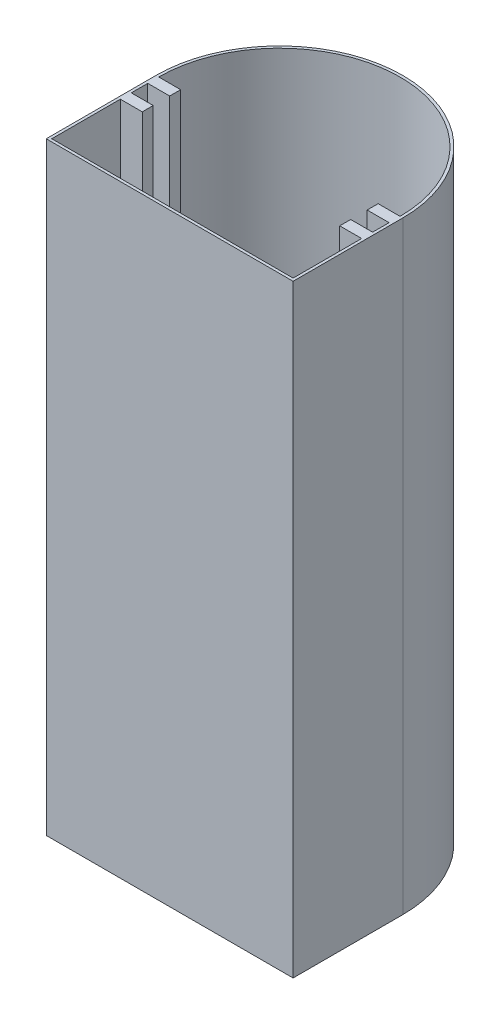
ISO-10303-21;
HEADER;
FILE_DESCRIPTION(('STEP AP214'),'2;1');
FILE_NAME('part.step','',(''),(''),'','','');
FILE_SCHEMA(('AUTOMOTIVE_DESIGN { 1 0 10303 214 1 1 1 1 }'));
ENDSEC;
DATA;
#1=APPLICATION_CONTEXT('core data for automotive mechanical design processes');
#2=APPLICATION_PROTOCOL_DEFINITION('international standard','automotive_design',2000,#1);
#3=PRODUCT_CONTEXT('',#1,'mechanical');
#4=PRODUCT('Part','Part','',(#3));
#5=PRODUCT_RELATED_PRODUCT_CATEGORY('part','',(#4));
#6=PRODUCT_DEFINITION_FORMATION('','',#4);
#7=PRODUCT_DEFINITION_CONTEXT('part definition',#1,'design');
#8=PRODUCT_DEFINITION('design','',#6,#7);
#9=PRODUCT_DEFINITION_SHAPE('','',#8);
#10=(LENGTH_UNIT() NAMED_UNIT(*) SI_UNIT(.MILLI.,.METRE.));
#11=(NAMED_UNIT(*) PLANE_ANGLE_UNIT() SI_UNIT($,.RADIAN.));
#12=(NAMED_UNIT(*) SI_UNIT($,.STERADIAN.) SOLID_ANGLE_UNIT());
#13=UNCERTAINTY_MEASURE_WITH_UNIT(LENGTH_MEASURE(1.E-05),#10,'distance_accuracy_value','');
#14=(GEOMETRIC_REPRESENTATION_CONTEXT(3) GLOBAL_UNCERTAINTY_ASSIGNED_CONTEXT((#13)) GLOBAL_UNIT_ASSIGNED_CONTEXT((#10,
#11,#12)) REPRESENTATION_CONTEXT('',''));
#15=CARTESIAN_POINT('',(0.,0.,0.));
#16=DIRECTION('',(0.,0.,1.));
#17=DIRECTION('',(1.,0.,0.));
#18=AXIS2_PLACEMENT_3D('',#15,#16,#17);
#19=CARTESIAN_POINT('',(-43.8830935251799,110.,1.70773381294964));
#20=DIRECTION('',(0.,0.,-1.));
#21=DIRECTION('',(-1.,0.,0.));
#22=AXIS2_PLACEMENT_3D('',#19,#20,#21);
#23=PLANE('',#22);
#24=DIRECTION('',(1.,0.,0.));
#25=VECTOR('',#24,1.);
#26=CARTESIAN_POINT('',(-43.8830935251799,0.,1.70773381294964));
#27=LINE('',#26,#25);
#28=CARTESIAN_POINT('',(-43.8830935251799,0.,1.70773381294964));
#29=VERTEX_POINT('',#28);
#30=CARTESIAN_POINT('',(1.11690647482014,0.,1.70773381294964));
#31=VERTEX_POINT('',#30);
#32=EDGE_CURVE('E311',#29,#31,#27,.T.);
#33=ORIENTED_EDGE('',*,*,#32,.T.);
#34=DIRECTION('',(0.,-1.,0.));
#35=VECTOR('',#34,1.);
#36=CARTESIAN_POINT('',(1.11690647482014,110.,1.70773381294964));
#37=LINE('',#36,#35);
#38=CARTESIAN_POINT('',(1.11690647482014,110.,1.70773381294964));
#39=VERTEX_POINT('',#38);
#40=EDGE_CURVE('E11',#39,#31,#37,.T.);
#41=ORIENTED_EDGE('',*,*,#40,.F.);
#42=DIRECTION('',(1.,0.,0.));
#43=VECTOR('',#42,1.);
#44=CARTESIAN_POINT('',(-43.8830935251799,110.,1.70773381294964));
#45=LINE('',#44,#43);
#46=CARTESIAN_POINT('',(-43.8830935251799,110.,1.70773381294964));
#47=VERTEX_POINT('',#46);
#48=EDGE_CURVE('E343',#47,#39,#45,.T.);
#49=ORIENTED_EDGE('',*,*,#48,.F.);
#50=DIRECTION('',(0.,-1.,0.));
#51=VECTOR('',#50,1.);
#52=CARTESIAN_POINT('',(-43.8830935251799,110.,1.70773381294964));
#53=LINE('',#52,#51);
#54=EDGE_CURVE('E57',#47,#29,#53,.T.);
#55=ORIENTED_EDGE('',*,*,#54,.T.);
#56=EDGE_LOOP('',(#33,#41,#49,#55));
#57=FACE_BOUND('',#56,.T.);
#58=ADVANCED_FACE('F33',(#57),#23,.F.);
#59=CARTESIAN_POINT('',(1.11690647482014,110.,1.70773381294964));
#60=DIRECTION('',(-1.,0.,0.));
#61=DIRECTION('',(0.,0.,1.));
#62=AXIS2_PLACEMENT_3D('',#59,#60,#61);
#63=PLANE('',#62);
#64=DIRECTION('',(0.,0.,-1.));
#65=VECTOR('',#64,1.);
#66=CARTESIAN_POINT('',(1.11690647482014,0.,1.70773381294964));
#67=LINE('',#66,#65);
#68=CARTESIAN_POINT('',(1.11690647482014,0.,-18.2922661870504));
#69=VERTEX_POINT('',#68);
#70=EDGE_CURVE('E352',#31,#69,#67,.T.);
#71=ORIENTED_EDGE('',*,*,#70,.T.);
#72=DIRECTION('',(0.,-1.,0.));
#73=VECTOR('',#72,1.);
#74=CARTESIAN_POINT('',(1.11690647482014,110.,-18.2922661870504));
#75=LINE('',#74,#73);
#76=CARTESIAN_POINT('',(1.11690647482014,110.,-18.2922661870504));
#77=VERTEX_POINT('',#76);
#78=EDGE_CURVE('E41',#77,#69,#75,.T.);
#79=ORIENTED_EDGE('',*,*,#78,.F.);
#80=DIRECTION('',(0.,0.,-1.));
#81=VECTOR('',#80,1.);
#82=CARTESIAN_POINT('',(1.11690647482014,110.,1.70773381294964));
#83=LINE('',#82,#81);
#84=EDGE_CURVE('E83',#39,#77,#83,.T.);
#85=ORIENTED_EDGE('',*,*,#84,.F.);
#86=ORIENTED_EDGE('',*,*,#40,.T.);
#87=EDGE_LOOP('',(#71,#79,#85,#86));
#88=FACE_BOUND('',#87,.T.);
#89=ADVANCED_FACE('F375',(#88),#63,.F.);
#90=CARTESIAN_POINT('',(-21.3830935251799,110.,-18.2922661870504));
#91=DIRECTION('',(0.,-1.,0.));
#92=DIRECTION('',(0.,0.,-1.));
#93=AXIS2_PLACEMENT_3D('',#90,#91,#92);
#94=CYLINDRICAL_SURFACE('',#93,22.5);
#95=CARTESIAN_POINT('',(-21.3830935251799,0.,-18.2922661870504));
#96=DIRECTION('',(0.,1.,0.));
#97=DIRECTION('',(0.,0.,1.));
#98=AXIS2_PLACEMENT_3D('',#95,#96,#97);
#99=CIRCLE('',#98,22.5);
#100=CARTESIAN_POINT('',(-43.8830935251799,0.,-18.2922661870504));
#101=VERTEX_POINT('',#100);
#102=EDGE_CURVE('E354',#69,#101,#99,.T.);
#103=ORIENTED_EDGE('',*,*,#102,.T.);
#104=DIRECTION('',(0.,-1.,0.));
#105=VECTOR('',#104,1.);
#106=CARTESIAN_POINT('',(-43.8830935251799,110.,-18.2922661870504));
#107=LINE('',#106,#105);
#108=CARTESIAN_POINT('',(-43.8830935251799,110.,-18.2922661870504));
#109=VERTEX_POINT('',#108);
#110=EDGE_CURVE('E360',#109,#101,#107,.T.);
#111=ORIENTED_EDGE('',*,*,#110,.F.);
#112=CARTESIAN_POINT('',(-21.3830935251799,110.,-18.2922661870504));
#113=DIRECTION('',(0.,1.,0.));
#114=DIRECTION('',(0.,0.,1.));
#115=AXIS2_PLACEMENT_3D('',#112,#113,#114);
#116=CIRCLE('',#115,22.5);
#117=EDGE_CURVE('E347',#77,#109,#116,.T.);
#118=ORIENTED_EDGE('',*,*,#117,.F.);
#119=ORIENTED_EDGE('',*,*,#78,.T.);
#120=EDGE_LOOP('',(#103,#111,#118,#119));
#121=FACE_BOUND('',#120,.T.);
#122=ADVANCED_FACE('F366',(#121),#94,.T.);
#123=CARTESIAN_POINT('',(-43.8830935251799,110.,1.70773381294964));
#124=DIRECTION('',(-1.,0.,0.));
#125=DIRECTION('',(0.,0.,1.));
#126=AXIS2_PLACEMENT_3D('',#123,#124,#125);
#127=PLANE('',#126);
#128=CARTESIAN_POINT('',(-43.8830935251799,55.,-4.95893285371703));
#129=DIRECTION('',(-1.,0.,0.));
#130=DIRECTION('',(0.,0.,1.));
#131=AXIS2_PLACEMENT_3D('',#128,#129,#130);
#132=CIRCLE('',#131,2.875);
#133=CARTESIAN_POINT('',(-43.8830935251799,55.,-2.08393285371702));
#134=VERTEX_POINT('',#133);
#135=EDGE_CURVE('E217',#134,#134,#132,.T.);
#136=ORIENTED_EDGE('',*,*,#135,.F.);
#137=EDGE_LOOP('',(#136));
#138=FACE_BOUND('',#137,.T.);
#139=DIRECTION('',(0.,0.,-1.));
#140=VECTOR('',#139,1.);
#141=CARTESIAN_POINT('',(-43.8830935251799,0.,1.70773381294964));
#142=LINE('',#141,#140);
#143=EDGE_CURVE('E345',#29,#101,#142,.T.);
#144=ORIENTED_EDGE('',*,*,#143,.F.);
#145=ORIENTED_EDGE('',*,*,#54,.F.);
#146=DIRECTION('',(0.,0.,-1.));
#147=VECTOR('',#146,1.);
#148=CARTESIAN_POINT('',(-43.8830935251799,110.,1.70773381294964));
#149=LINE('',#148,#147);
#150=EDGE_CURVE('E349',#47,#109,#149,.T.);
#151=ORIENTED_EDGE('',*,*,#150,.T.);
#152=ORIENTED_EDGE('',*,*,#110,.T.);
#153=EDGE_LOOP('',(#144,#145,#151,#152));
#154=FACE_BOUND('',#153,.T.);
#155=ADVANCED_FACE('F370',(#138,#154),#127,.T.);
#156=CARTESIAN_POINT('',(-21.3830935251799,110.,-18.2922661870504));
#157=DIRECTION('',(0.,1.,0.));
#158=DIRECTION('',(0.,0.,1.));
#159=AXIS2_PLACEMENT_3D('',#156,#157,#158);
#160=PLANE('',#159);
#161=CARTESIAN_POINT('',(-21.3830935251799,110.,-18.2922661870504));
#162=DIRECTION('',(0.,1.,0.));
#163=DIRECTION('',(0.,0.,1.));
#164=AXIS2_PLACEMENT_3D('',#161,#162,#163);
#165=CIRCLE('',#164,22.);
#166=CARTESIAN_POINT('',(0.616906474820142,110.,-18.2922661870504));
#167=VERTEX_POINT('',#166);
#168=CARTESIAN_POINT('',(-43.3830935251799,110.,-18.2922661870504));
#169=VERTEX_POINT('',#168);
#170=EDGE_CURVE('E48',#167,#169,#165,.T.);
#171=ORIENTED_EDGE('',*,*,#170,.F.);
#172=DIRECTION('',(1.,0.,0.));
#173=VECTOR('',#172,1.);
#174=CARTESIAN_POINT('',(0.616906474820142,110.,-18.2922661870504));
#175=LINE('',#174,#173);
#176=CARTESIAN_POINT('',(-3.38309352517986,110.,-18.2922661870504));
#177=VERTEX_POINT('',#176);
#178=EDGE_CURVE('E211',#177,#167,#175,.T.);
#179=ORIENTED_EDGE('',*,*,#178,.F.);
#180=DIRECTION('',(0.,0.,-1.));
#181=VECTOR('',#180,1.);
#182=CARTESIAN_POINT('',(-3.38309352517986,110.,-18.2922661870504));
#183=LINE('',#182,#181);
#184=CARTESIAN_POINT('',(-3.38309352517986,110.,-16.2922661870504));
#185=VERTEX_POINT('',#184);
#186=EDGE_CURVE('E214',#185,#177,#183,.T.);
#187=ORIENTED_EDGE('',*,*,#186,.F.);
#188=DIRECTION('',(-1.,0.,0.));
#189=VECTOR('',#188,1.);
#190=CARTESIAN_POINT('',(-3.38309352517986,110.,-16.2922661870504));
#191=LINE('',#190,#189);
#192=CARTESIAN_POINT('',(0.616906474820142,110.,-16.2922661870504));
#193=VERTEX_POINT('',#192);
#194=EDGE_CURVE('E304',#193,#185,#191,.T.);
#195=ORIENTED_EDGE('',*,*,#194,.F.);
#196=DIRECTION('',(0.,0.,-1.));
#197=VECTOR('',#196,1.);
#198=CARTESIAN_POINT('',(0.616906474820142,110.,-16.2922661870504));
#199=LINE('',#198,#197);
#200=CARTESIAN_POINT('',(0.616906474820142,110.,-13.2922661870504));
#201=VERTEX_POINT('',#200);
#202=EDGE_CURVE('E301',#201,#193,#199,.T.);
#203=ORIENTED_EDGE('',*,*,#202,.F.);
#204=DIRECTION('',(1.,0.,0.));
#205=VECTOR('',#204,1.);
#206=CARTESIAN_POINT('',(0.616906474820142,110.,-13.2922661870504));
#207=LINE('',#206,#205);
#208=CARTESIAN_POINT('',(-3.38309352517986,110.,-13.2922661870504));
#209=VERTEX_POINT('',#208);
#210=EDGE_CURVE('E298',#209,#201,#207,.T.);
#211=ORIENTED_EDGE('',*,*,#210,.F.);
#212=DIRECTION('',(0.,0.,-1.));
#213=VECTOR('',#212,1.);
#214=CARTESIAN_POINT('',(-3.38309352517986,110.,-13.2922661870504));
#215=LINE('',#214,#213);
#216=CARTESIAN_POINT('',(-3.38309352517986,110.,-11.2922661870504));
#217=VERTEX_POINT('',#216);
#218=EDGE_CURVE('E295',#217,#209,#215,.T.);
#219=ORIENTED_EDGE('',*,*,#218,.F.);
#220=DIRECTION('',(-1.,0.,0.));
#221=VECTOR('',#220,1.);
#222=CARTESIAN_POINT('',(-3.38309352517986,110.,-11.2922661870504));
#223=LINE('',#222,#221);
#224=CARTESIAN_POINT('',(0.616906474820142,110.,-11.2922661870504));
#225=VERTEX_POINT('',#224);
#226=EDGE_CURVE('E292',#225,#217,#223,.T.);
#227=ORIENTED_EDGE('',*,*,#226,.F.);
#228=DIRECTION('',(0.,0.,-1.));
#229=VECTOR('',#228,1.);
#230=CARTESIAN_POINT('',(0.616906474820142,110.,-11.2922661870504));
#231=LINE('',#230,#229);
#232=CARTESIAN_POINT('',(0.616906474820142,110.,1.20773381294964));
#233=VERTEX_POINT('',#232);
#234=EDGE_CURVE('E289',#233,#225,#231,.T.);
#235=ORIENTED_EDGE('',*,*,#234,.F.);
#236=DIRECTION('',(1.,0.,0.));
#237=VECTOR('',#236,1.);
#238=CARTESIAN_POINT('',(-43.3830935251799,110.,1.20773381294964));
#239=LINE('',#238,#237);
#240=CARTESIAN_POINT('',(-43.3830935251799,110.,1.20773381294964));
#241=VERTEX_POINT('',#240);
#242=EDGE_CURVE('E286',#241,#233,#239,.T.);
#243=ORIENTED_EDGE('',*,*,#242,.F.);
#244=DIRECTION('',(0.,0.,1.));
#245=VECTOR('',#244,1.);
#246=CARTESIAN_POINT('',(-43.3830935251799,110.,-11.2922661870504));
#247=LINE('',#246,#245);
#248=CARTESIAN_POINT('',(-43.3830935251799,110.,-11.2922661870504));
#249=VERTEX_POINT('',#248);
#250=EDGE_CURVE('E283',#249,#241,#247,.T.);
#251=ORIENTED_EDGE('',*,*,#250,.F.);
#252=DIRECTION('',(-1.,0.,0.));
#253=VECTOR('',#252,1.);
#254=CARTESIAN_POINT('',(-39.3830935251799,110.,-11.2922661870504));
#255=LINE('',#254,#253);
#256=CARTESIAN_POINT('',(-39.3830935251799,110.,-11.2922661870504));
#257=VERTEX_POINT('',#256);
#258=EDGE_CURVE('E280',#257,#249,#255,.T.);
#259=ORIENTED_EDGE('',*,*,#258,.F.);
#260=DIRECTION('',(0.,0.,1.));
#261=VECTOR('',#260,1.);
#262=CARTESIAN_POINT('',(-39.3830935251799,110.,-13.2922661870504));
#263=LINE('',#262,#261);
#264=CARTESIAN_POINT('',(-39.3830935251799,110.,-13.2922661870504));
#265=VERTEX_POINT('',#264);
#266=EDGE_CURVE('E277',#265,#257,#263,.T.);
#267=ORIENTED_EDGE('',*,*,#266,.F.);
#268=DIRECTION('',(1.,0.,0.));
#269=VECTOR('',#268,1.);
#270=CARTESIAN_POINT('',(-43.3830935251799,110.,-13.2922661870504));
#271=LINE('',#270,#269);
#272=CARTESIAN_POINT('',(-43.3830935251799,110.,-13.2922661870504));
#273=VERTEX_POINT('',#272);
#274=EDGE_CURVE('E274',#273,#265,#271,.T.);
#275=ORIENTED_EDGE('',*,*,#274,.F.);
#276=DIRECTION('',(0.,0.,1.));
#277=VECTOR('',#276,1.);
#278=CARTESIAN_POINT('',(-43.3830935251799,110.,-16.2922661870504));
#279=LINE('',#278,#277);
#280=CARTESIAN_POINT('',(-43.3830935251799,110.,-16.2922661870504));
#281=VERTEX_POINT('',#280);
#282=EDGE_CURVE('E271',#281,#273,#279,.T.);
#283=ORIENTED_EDGE('',*,*,#282,.F.);
#284=DIRECTION('',(-1.,0.,0.));
#285=VECTOR('',#284,1.);
#286=CARTESIAN_POINT('',(-39.3830935251799,110.,-16.2922661870504));
#287=LINE('',#286,#285);
#288=CARTESIAN_POINT('',(-39.3830935251799,110.,-16.2922661870504));
#289=VERTEX_POINT('',#288);
#290=EDGE_CURVE('E268',#289,#281,#287,.T.);
#291=ORIENTED_EDGE('',*,*,#290,.F.);
#292=DIRECTION('',(0.,0.,1.));
#293=VECTOR('',#292,1.);
#294=CARTESIAN_POINT('',(-39.3830935251799,110.,-18.2922661870504));
#295=LINE('',#294,#293);
#296=CARTESIAN_POINT('',(-39.3830935251799,110.,-18.2922661870504));
#297=VERTEX_POINT('',#296);
#298=EDGE_CURVE('E265',#297,#289,#295,.T.);
#299=ORIENTED_EDGE('',*,*,#298,.F.);
#300=DIRECTION('',(1.,0.,0.));
#301=VECTOR('',#300,1.);
#302=CARTESIAN_POINT('',(-43.3830935251799,110.,-18.2922661870504));
#303=LINE('',#302,#301);
#304=EDGE_CURVE('E263',#169,#297,#303,.T.);
#305=ORIENTED_EDGE('',*,*,#304,.F.);
#306=EDGE_LOOP('',(#171,#179,#187,#195,#203,#211,#219,#227,#235,#243,#251,#259,#267,#275,#283,
#291,#299,#305));
#307=FACE_BOUND('',#306,.T.);
#308=ORIENTED_EDGE('',*,*,#48,.T.);
#309=ORIENTED_EDGE('',*,*,#84,.T.);
#310=ORIENTED_EDGE('',*,*,#117,.T.);
#311=ORIENTED_EDGE('',*,*,#150,.F.);
#312=EDGE_LOOP('',(#308,#309,#310,#311));
#313=FACE_BOUND('',#312,.T.);
#314=ADVANCED_FACE('F373',(#307,#313),#160,.T.);
#315=CARTESIAN_POINT('',(-21.3830935251799,0.,-18.2922661870504));
#316=DIRECTION('',(0.,1.,0.));
#317=DIRECTION('',(0.,0.,1.));
#318=AXIS2_PLACEMENT_3D('',#315,#316,#317);
#319=PLANE('',#318);
#320=ORIENTED_EDGE('',*,*,#32,.F.);
#321=ORIENTED_EDGE('',*,*,#143,.T.);
#322=ORIENTED_EDGE('',*,*,#102,.F.);
#323=ORIENTED_EDGE('',*,*,#70,.F.);
#324=EDGE_LOOP('',(#320,#321,#322,#323));
#325=FACE_BOUND('',#324,.T.);
#326=ADVANCED_FACE('F369',(#325),#319,.F.);
#327=CARTESIAN_POINT('',(-21.3830935251799,0.5,-18.2922661870504));
#328=DIRECTION('',(0.,1.,0.));
#329=DIRECTION('',(0.,0.,1.));
#330=AXIS2_PLACEMENT_3D('',#327,#328,#329);
#331=CYLINDRICAL_SURFACE('',#330,22.);
#332=ORIENTED_EDGE('',*,*,#170,.T.);
#333=DIRECTION('',(0.,1.,0.));
#334=VECTOR('',#333,1.);
#335=CARTESIAN_POINT('',(-43.3830935251799,0.5,-18.2922661870504));
#336=LINE('',#335,#334);
#337=CARTESIAN_POINT('',(-43.3830935251799,0.5,-18.2922661870504));
#338=VERTEX_POINT('',#337);
#339=EDGE_CURVE('E188',#338,#169,#336,.T.);
#340=ORIENTED_EDGE('',*,*,#339,.F.);
#341=CARTESIAN_POINT('',(-21.3830935251799,0.5,-18.2922661870504));
#342=DIRECTION('',(0.,1.,0.));
#343=DIRECTION('',(0.,0.,1.));
#344=AXIS2_PLACEMENT_3D('',#341,#342,#343);
#345=CIRCLE('',#344,22.);
#346=CARTESIAN_POINT('',(0.616906474820142,0.5,-18.2922661870504));
#347=VERTEX_POINT('',#346);
#348=EDGE_CURVE('E192',#347,#338,#345,.T.);
#349=ORIENTED_EDGE('',*,*,#348,.F.);
#350=DIRECTION('',(0.,1.,0.));
#351=VECTOR('',#350,1.);
#352=CARTESIAN_POINT('',(0.616906474820142,0.5,-18.2922661870504));
#353=LINE('',#352,#351);
#354=EDGE_CURVE('E309',#347,#167,#353,.T.);
#355=ORIENTED_EDGE('',*,*,#354,.T.);
#356=EDGE_LOOP('',(#332,#340,#349,#355));
#357=FACE_BOUND('',#356,.T.);
#358=ADVANCED_FACE('F190',(#357),#331,.F.);
#359=CARTESIAN_POINT('',(0.616906474820142,0.5,-18.2922661870504));
#360=DIRECTION('',(0.,0.,1.));
#361=DIRECTION('',(1.,0.,0.));
#362=AXIS2_PLACEMENT_3D('',#359,#360,#361);
#363=PLANE('',#362);
#364=ORIENTED_EDGE('',*,*,#178,.T.);
#365=ORIENTED_EDGE('',*,*,#354,.F.);
#366=DIRECTION('',(1.,0.,0.));
#367=VECTOR('',#366,1.);
#368=CARTESIAN_POINT('',(0.616906474820142,0.5,-18.2922661870504));
#369=LINE('',#368,#367);
#370=CARTESIAN_POINT('',(-3.38309352517986,0.5,-18.2922661870504));
#371=VERTEX_POINT('',#370);
#372=EDGE_CURVE('E198',#371,#347,#369,.T.);
#373=ORIENTED_EDGE('',*,*,#372,.F.);
#374=DIRECTION('',(0.,1.,0.));
#375=VECTOR('',#374,1.);
#376=CARTESIAN_POINT('',(-3.38309352517986,0.5,-18.2922661870504));
#377=LINE('',#376,#375);
#378=EDGE_CURVE('E312',#371,#177,#377,.T.);
#379=ORIENTED_EDGE('',*,*,#378,.T.);
#380=EDGE_LOOP('',(#364,#365,#373,#379));
#381=FACE_BOUND('',#380,.T.);
#382=ADVANCED_FACE('F393',(#381),#363,.F.);
#383=CARTESIAN_POINT('',(-3.38309352517986,0.5,-18.2922661870504));
#384=DIRECTION('',(1.,0.,0.));
#385=DIRECTION('',(0.,0.,-1.));
#386=AXIS2_PLACEMENT_3D('',#383,#384,#385);
#387=PLANE('',#386);
#388=ORIENTED_EDGE('',*,*,#186,.T.);
#389=ORIENTED_EDGE('',*,*,#378,.F.);
#390=DIRECTION('',(0.,0.,-1.));
#391=VECTOR('',#390,1.);
#392=CARTESIAN_POINT('',(-3.38309352517986,0.5,-18.2922661870504));
#393=LINE('',#392,#391);
#394=CARTESIAN_POINT('',(-3.38309352517986,0.5,-16.2922661870504));
#395=VERTEX_POINT('',#394);
#396=EDGE_CURVE('E259',#395,#371,#393,.T.);
#397=ORIENTED_EDGE('',*,*,#396,.F.);
#398=DIRECTION('',(0.,1.,0.));
#399=VECTOR('',#398,1.);
#400=CARTESIAN_POINT('',(-3.38309352517986,0.5,-16.2922661870504));
#401=LINE('',#400,#399);
#402=EDGE_CURVE('E314',#395,#185,#401,.T.);
#403=ORIENTED_EDGE('',*,*,#402,.T.);
#404=EDGE_LOOP('',(#388,#389,#397,#403));
#405=FACE_BOUND('',#404,.T.);
#406=ADVANCED_FACE('F451',(#405),#387,.F.);
#407=CARTESIAN_POINT('',(-3.38309352517986,0.5,-16.2922661870504));
#408=DIRECTION('',(0.,0.,-1.));
#409=DIRECTION('',(-1.,0.,0.));
#410=AXIS2_PLACEMENT_3D('',#407,#408,#409);
#411=PLANE('',#410);
#412=ORIENTED_EDGE('',*,*,#194,.T.);
#413=ORIENTED_EDGE('',*,*,#402,.F.);
#414=DIRECTION('',(-1.,0.,0.));
#415=VECTOR('',#414,1.);
#416=CARTESIAN_POINT('',(-3.38309352517986,0.5,-16.2922661870504));
#417=LINE('',#416,#415);
#418=CARTESIAN_POINT('',(0.616906474820142,0.5,-16.2922661870504));
#419=VERTEX_POINT('',#418);
#420=EDGE_CURVE('E256',#419,#395,#417,.T.);
#421=ORIENTED_EDGE('',*,*,#420,.F.);
#422=DIRECTION('',(0.,1.,0.));
#423=VECTOR('',#422,1.);
#424=CARTESIAN_POINT('',(0.616906474820142,0.5,-16.2922661870504));
#425=LINE('',#424,#423);
#426=EDGE_CURVE('E316',#419,#193,#425,.T.);
#427=ORIENTED_EDGE('',*,*,#426,.T.);
#428=EDGE_LOOP('',(#412,#413,#421,#427));
#429=FACE_BOUND('',#428,.T.);
#430=ADVANCED_FACE('F447',(#429),#411,.F.);
#431=CARTESIAN_POINT('',(0.616906474820142,0.5,-16.2922661870504));
#432=DIRECTION('',(1.,0.,0.));
#433=DIRECTION('',(0.,0.,-1.));
#434=AXIS2_PLACEMENT_3D('',#431,#432,#433);
#435=PLANE('',#434);
#436=ORIENTED_EDGE('',*,*,#202,.T.);
#437=ORIENTED_EDGE('',*,*,#426,.F.);
#438=DIRECTION('',(0.,0.,-1.));
#439=VECTOR('',#438,1.);
#440=CARTESIAN_POINT('',(0.616906474820142,0.5,-16.2922661870504));
#441=LINE('',#440,#439);
#442=CARTESIAN_POINT('',(0.616906474820142,0.5,-13.2922661870504));
#443=VERTEX_POINT('',#442);
#444=EDGE_CURVE('E253',#443,#419,#441,.T.);
#445=ORIENTED_EDGE('',*,*,#444,.F.);
#446=DIRECTION('',(0.,1.,0.));
#447=VECTOR('',#446,1.);
#448=CARTESIAN_POINT('',(0.616906474820142,0.5,-13.2922661870504));
#449=LINE('',#448,#447);
#450=EDGE_CURVE('E318',#443,#201,#449,.T.);
#451=ORIENTED_EDGE('',*,*,#450,.T.);
#452=EDGE_LOOP('',(#436,#437,#445,#451));
#453=FACE_BOUND('',#452,.T.);
#454=ADVANCED_FACE('F443',(#453),#435,.F.);
#455=CARTESIAN_POINT('',(0.616906474820142,0.5,-13.2922661870504));
#456=DIRECTION('',(0.,0.,1.));
#457=DIRECTION('',(1.,0.,0.));
#458=AXIS2_PLACEMENT_3D('',#455,#456,#457);
#459=PLANE('',#458);
#460=ORIENTED_EDGE('',*,*,#210,.T.);
#461=ORIENTED_EDGE('',*,*,#450,.F.);
#462=DIRECTION('',(1.,0.,0.));
#463=VECTOR('',#462,1.);
#464=CARTESIAN_POINT('',(0.616906474820142,0.5,-13.2922661870504));
#465=LINE('',#464,#463);
#466=CARTESIAN_POINT('',(-3.38309352517986,0.5,-13.2922661870504));
#467=VERTEX_POINT('',#466);
#468=EDGE_CURVE('E250',#467,#443,#465,.T.);
#469=ORIENTED_EDGE('',*,*,#468,.F.);
#470=DIRECTION('',(0.,1.,0.));
#471=VECTOR('',#470,1.);
#472=CARTESIAN_POINT('',(-3.38309352517986,0.5,-13.2922661870504));
#473=LINE('',#472,#471);
#474=EDGE_CURVE('E320',#467,#209,#473,.T.);
#475=ORIENTED_EDGE('',*,*,#474,.T.);
#476=EDGE_LOOP('',(#460,#461,#469,#475));
#477=FACE_BOUND('',#476,.T.);
#478=ADVANCED_FACE('F439',(#477),#459,.F.);
#479=CARTESIAN_POINT('',(-3.38309352517986,0.5,-13.2922661870504));
#480=DIRECTION('',(1.,0.,0.));
#481=DIRECTION('',(0.,0.,-1.));
#482=AXIS2_PLACEMENT_3D('',#479,#480,#481);
#483=PLANE('',#482);
#484=ORIENTED_EDGE('',*,*,#218,.T.);
#485=ORIENTED_EDGE('',*,*,#474,.F.);
#486=DIRECTION('',(0.,0.,-1.));
#487=VECTOR('',#486,1.);
#488=CARTESIAN_POINT('',(-3.38309352517986,0.5,-13.2922661870504));
#489=LINE('',#488,#487);
#490=CARTESIAN_POINT('',(-3.38309352517986,0.5,-11.2922661870504));
#491=VERTEX_POINT('',#490);
#492=EDGE_CURVE('E247',#491,#467,#489,.T.);
#493=ORIENTED_EDGE('',*,*,#492,.F.);
#494=DIRECTION('',(0.,1.,0.));
#495=VECTOR('',#494,1.);
#496=CARTESIAN_POINT('',(-3.38309352517986,0.5,-11.2922661870504));
#497=LINE('',#496,#495);
#498=EDGE_CURVE('E322',#491,#217,#497,.T.);
#499=ORIENTED_EDGE('',*,*,#498,.T.);
#500=EDGE_LOOP('',(#484,#485,#493,#499));
#501=FACE_BOUND('',#500,.T.);
#502=ADVANCED_FACE('F435',(#501),#483,.F.);
#503=CARTESIAN_POINT('',(-3.38309352517986,0.5,-11.2922661870504));
#504=DIRECTION('',(0.,0.,-1.));
#505=DIRECTION('',(-1.,0.,0.));
#506=AXIS2_PLACEMENT_3D('',#503,#504,#505);
#507=PLANE('',#506);
#508=ORIENTED_EDGE('',*,*,#226,.T.);
#509=ORIENTED_EDGE('',*,*,#498,.F.);
#510=DIRECTION('',(-1.,0.,0.));
#511=VECTOR('',#510,1.);
#512=CARTESIAN_POINT('',(-3.38309352517986,0.5,-11.2922661870504));
#513=LINE('',#512,#511);
#514=CARTESIAN_POINT('',(0.616906474820142,0.5,-11.2922661870504));
#515=VERTEX_POINT('',#514);
#516=EDGE_CURVE('E244',#515,#491,#513,.T.);
#517=ORIENTED_EDGE('',*,*,#516,.F.);
#518=DIRECTION('',(0.,1.,0.));
#519=VECTOR('',#518,1.);
#520=CARTESIAN_POINT('',(0.616906474820142,0.5,-11.2922661870504));
#521=LINE('',#520,#519);
#522=EDGE_CURVE('E324',#515,#225,#521,.T.);
#523=ORIENTED_EDGE('',*,*,#522,.T.);
#524=EDGE_LOOP('',(#508,#509,#517,#523));
#525=FACE_BOUND('',#524,.T.);
#526=ADVANCED_FACE('F431',(#525),#507,.F.);
#527=CARTESIAN_POINT('',(0.616906474820142,0.5,-11.2922661870504));
#528=DIRECTION('',(1.,0.,0.));
#529=DIRECTION('',(0.,0.,-1.));
#530=AXIS2_PLACEMENT_3D('',#527,#528,#529);
#531=PLANE('',#530);
#532=ORIENTED_EDGE('',*,*,#234,.T.);
#533=ORIENTED_EDGE('',*,*,#522,.F.);
#534=DIRECTION('',(0.,0.,-1.));
#535=VECTOR('',#534,1.);
#536=CARTESIAN_POINT('',(0.616906474820142,0.5,-11.2922661870504));
#537=LINE('',#536,#535);
#538=CARTESIAN_POINT('',(0.616906474820142,0.5,1.20773381294964));
#539=VERTEX_POINT('',#538);
#540=EDGE_CURVE('E241',#539,#515,#537,.T.);
#541=ORIENTED_EDGE('',*,*,#540,.F.);
#542=DIRECTION('',(0.,1.,0.));
#543=VECTOR('',#542,1.);
#544=CARTESIAN_POINT('',(0.616906474820142,0.5,1.20773381294964));
#545=LINE('',#544,#543);
#546=EDGE_CURVE('E326',#539,#233,#545,.T.);
#547=ORIENTED_EDGE('',*,*,#546,.T.);
#548=EDGE_LOOP('',(#532,#533,#541,#547));
#549=FACE_BOUND('',#548,.T.);
#550=ADVANCED_FACE('F427',(#549),#531,.F.);
#551=CARTESIAN_POINT('',(-43.3830935251799,0.5,1.20773381294964));
#552=DIRECTION('',(0.,0.,1.));
#553=DIRECTION('',(1.,0.,0.));
#554=AXIS2_PLACEMENT_3D('',#551,#552,#553);
#555=PLANE('',#554);
#556=ORIENTED_EDGE('',*,*,#242,.T.);
#557=ORIENTED_EDGE('',*,*,#546,.F.);
#558=DIRECTION('',(1.,0.,0.));
#559=VECTOR('',#558,1.);
#560=CARTESIAN_POINT('',(-43.3830935251799,0.5,1.20773381294964));
#561=LINE('',#560,#559);
#562=CARTESIAN_POINT('',(-43.3830935251799,0.5,1.20773381294964));
#563=VERTEX_POINT('',#562);
#564=EDGE_CURVE('E238',#563,#539,#561,.T.);
#565=ORIENTED_EDGE('',*,*,#564,.F.);
#566=DIRECTION('',(0.,1.,0.));
#567=VECTOR('',#566,1.);
#568=CARTESIAN_POINT('',(-43.3830935251799,0.5,1.20773381294964));
#569=LINE('',#568,#567);
#570=EDGE_CURVE('E328',#563,#241,#569,.T.);
#571=ORIENTED_EDGE('',*,*,#570,.T.);
#572=EDGE_LOOP('',(#556,#557,#565,#571));
#573=FACE_BOUND('',#572,.T.);
#574=ADVANCED_FACE('F423',(#573),#555,.F.);
#575=CARTESIAN_POINT('',(-43.3830935251799,0.5,-11.2922661870504));
#576=DIRECTION('',(-1.,0.,0.));
#577=DIRECTION('',(0.,0.,1.));
#578=AXIS2_PLACEMENT_3D('',#575,#576,#577);
#579=PLANE('',#578);
#580=CARTESIAN_POINT('',(-43.3830935251799,55.,-4.95893285371703));
#581=DIRECTION('',(-1.,0.,0.));
#582=DIRECTION('',(0.,0.,1.));
#583=AXIS2_PLACEMENT_3D('',#580,#581,#582);
#584=CIRCLE('',#583,2.875);
#585=CARTESIAN_POINT('',(-43.3830935251799,55.,-2.08393285371702));
#586=VERTEX_POINT('',#585);
#587=EDGE_CURVE('E36',#586,#586,#584,.T.);
#588=ORIENTED_EDGE('',*,*,#587,.T.);
#589=EDGE_LOOP('',(#588));
#590=FACE_BOUND('',#589,.T.);
#591=ORIENTED_EDGE('',*,*,#250,.T.);
#592=ORIENTED_EDGE('',*,*,#570,.F.);
#593=DIRECTION('',(0.,0.,1.));
#594=VECTOR('',#593,1.);
#595=CARTESIAN_POINT('',(-43.3830935251799,0.5,-11.2922661870504));
#596=LINE('',#595,#594);
#597=CARTESIAN_POINT('',(-43.3830935251799,0.5,-11.2922661870504));
#598=VERTEX_POINT('',#597);
#599=EDGE_CURVE('E235',#598,#563,#596,.T.);
#600=ORIENTED_EDGE('',*,*,#599,.F.);
#601=DIRECTION('',(0.,1.,0.));
#602=VECTOR('',#601,1.);
#603=CARTESIAN_POINT('',(-43.3830935251799,0.5,-11.2922661870504));
#604=LINE('',#603,#602);
#605=EDGE_CURVE('E330',#598,#249,#604,.T.);
#606=ORIENTED_EDGE('',*,*,#605,.T.);
#607=EDGE_LOOP('',(#591,#592,#600,#606));
#608=FACE_BOUND('',#607,.T.);
#609=ADVANCED_FACE('F419',(#590,#608),#579,.F.);
#610=CARTESIAN_POINT('',(-39.3830935251799,0.5,-11.2922661870504));
#611=DIRECTION('',(0.,0.,-1.));
#612=DIRECTION('',(-1.,0.,0.));
#613=AXIS2_PLACEMENT_3D('',#610,#611,#612);
#614=PLANE('',#613);
#615=ORIENTED_EDGE('',*,*,#258,.T.);
#616=ORIENTED_EDGE('',*,*,#605,.F.);
#617=DIRECTION('',(-1.,0.,0.));
#618=VECTOR('',#617,1.);
#619=CARTESIAN_POINT('',(-39.3830935251799,0.5,-11.2922661870504));
#620=LINE('',#619,#618);
#621=CARTESIAN_POINT('',(-39.3830935251799,0.5,-11.2922661870504));
#622=VERTEX_POINT('',#621);
#623=EDGE_CURVE('E232',#622,#598,#620,.T.);
#624=ORIENTED_EDGE('',*,*,#623,.F.);
#625=DIRECTION('',(0.,1.,0.));
#626=VECTOR('',#625,1.);
#627=CARTESIAN_POINT('',(-39.3830935251799,0.5,-11.2922661870504));
#628=LINE('',#627,#626);
#629=EDGE_CURVE('E332',#622,#257,#628,.T.);
#630=ORIENTED_EDGE('',*,*,#629,.T.);
#631=EDGE_LOOP('',(#615,#616,#624,#630));
#632=FACE_BOUND('',#631,.T.);
#633=ADVANCED_FACE('F415',(#632),#614,.F.);
#634=CARTESIAN_POINT('',(-39.3830935251799,0.5,-13.2922661870504));
#635=DIRECTION('',(-1.,0.,0.));
#636=DIRECTION('',(0.,0.,1.));
#637=AXIS2_PLACEMENT_3D('',#634,#635,#636);
#638=PLANE('',#637);
#639=ORIENTED_EDGE('',*,*,#266,.T.);
#640=ORIENTED_EDGE('',*,*,#629,.F.);
#641=DIRECTION('',(0.,0.,1.));
#642=VECTOR('',#641,1.);
#643=CARTESIAN_POINT('',(-39.3830935251799,0.5,-13.2922661870504));
#644=LINE('',#643,#642);
#645=CARTESIAN_POINT('',(-39.3830935251799,0.5,-13.2922661870504));
#646=VERTEX_POINT('',#645);
#647=EDGE_CURVE('E229',#646,#622,#644,.T.);
#648=ORIENTED_EDGE('',*,*,#647,.F.);
#649=DIRECTION('',(0.,1.,0.));
#650=VECTOR('',#649,1.);
#651=CARTESIAN_POINT('',(-39.3830935251799,0.5,-13.2922661870504));
#652=LINE('',#651,#650);
#653=EDGE_CURVE('E334',#646,#265,#652,.T.);
#654=ORIENTED_EDGE('',*,*,#653,.T.);
#655=EDGE_LOOP('',(#639,#640,#648,#654));
#656=FACE_BOUND('',#655,.T.);
#657=ADVANCED_FACE('F411',(#656),#638,.F.);
#658=CARTESIAN_POINT('',(-43.3830935251799,0.5,-13.2922661870504));
#659=DIRECTION('',(0.,0.,1.));
#660=DIRECTION('',(1.,0.,0.));
#661=AXIS2_PLACEMENT_3D('',#658,#659,#660);
#662=PLANE('',#661);
#663=ORIENTED_EDGE('',*,*,#274,.T.);
#664=ORIENTED_EDGE('',*,*,#653,.F.);
#665=DIRECTION('',(1.,0.,0.));
#666=VECTOR('',#665,1.);
#667=CARTESIAN_POINT('',(-43.3830935251799,0.5,-13.2922661870504));
#668=LINE('',#667,#666);
#669=CARTESIAN_POINT('',(-43.3830935251799,0.5,-13.2922661870504));
#670=VERTEX_POINT('',#669);
#671=EDGE_CURVE('E226',#670,#646,#668,.T.);
#672=ORIENTED_EDGE('',*,*,#671,.F.);
#673=DIRECTION('',(0.,1.,0.));
#674=VECTOR('',#673,1.);
#675=CARTESIAN_POINT('',(-43.3830935251799,0.5,-13.2922661870504));
#676=LINE('',#675,#674);
#677=EDGE_CURVE('E336',#670,#273,#676,.T.);
#678=ORIENTED_EDGE('',*,*,#677,.T.);
#679=EDGE_LOOP('',(#663,#664,#672,#678));
#680=FACE_BOUND('',#679,.T.);
#681=ADVANCED_FACE('F407',(#680),#662,.F.);
#682=CARTESIAN_POINT('',(-43.3830935251799,0.5,-16.2922661870504));
#683=DIRECTION('',(-1.,0.,0.));
#684=DIRECTION('',(0.,0.,1.));
#685=AXIS2_PLACEMENT_3D('',#682,#683,#684);
#686=PLANE('',#685);
#687=ORIENTED_EDGE('',*,*,#282,.T.);
#688=ORIENTED_EDGE('',*,*,#677,.F.);
#689=DIRECTION('',(0.,0.,1.));
#690=VECTOR('',#689,1.);
#691=CARTESIAN_POINT('',(-43.3830935251799,0.5,-16.2922661870504));
#692=LINE('',#691,#690);
#693=CARTESIAN_POINT('',(-43.3830935251799,0.5,-16.2922661870504));
#694=VERTEX_POINT('',#693);
#695=EDGE_CURVE('E223',#694,#670,#692,.T.);
#696=ORIENTED_EDGE('',*,*,#695,.F.);
#697=DIRECTION('',(0.,1.,0.));
#698=VECTOR('',#697,1.);
#699=CARTESIAN_POINT('',(-43.3830935251799,0.5,-16.2922661870504));
#700=LINE('',#699,#698);
#701=EDGE_CURVE('E338',#694,#281,#700,.T.);
#702=ORIENTED_EDGE('',*,*,#701,.T.);
#703=EDGE_LOOP('',(#687,#688,#696,#702));
#704=FACE_BOUND('',#703,.T.);
#705=ADVANCED_FACE('F403',(#704),#686,.F.);
#706=CARTESIAN_POINT('',(-39.3830935251799,0.5,-16.2922661870504));
#707=DIRECTION('',(0.,0.,-1.));
#708=DIRECTION('',(-1.,0.,0.));
#709=AXIS2_PLACEMENT_3D('',#706,#707,#708);
#710=PLANE('',#709);
#711=ORIENTED_EDGE('',*,*,#290,.T.);
#712=ORIENTED_EDGE('',*,*,#701,.F.);
#713=DIRECTION('',(-1.,0.,0.));
#714=VECTOR('',#713,1.);
#715=CARTESIAN_POINT('',(-39.3830935251799,0.5,-16.2922661870504));
#716=LINE('',#715,#714);
#717=CARTESIAN_POINT('',(-39.3830935251799,0.5,-16.2922661870504));
#718=VERTEX_POINT('',#717);
#719=EDGE_CURVE('E220',#718,#694,#716,.T.);
#720=ORIENTED_EDGE('',*,*,#719,.F.);
#721=DIRECTION('',(0.,1.,0.));
#722=VECTOR('',#721,1.);
#723=CARTESIAN_POINT('',(-39.3830935251799,0.5,-16.2922661870504));
#724=LINE('',#723,#722);
#725=EDGE_CURVE('E340',#718,#289,#724,.T.);
#726=ORIENTED_EDGE('',*,*,#725,.T.);
#727=EDGE_LOOP('',(#711,#712,#720,#726));
#728=FACE_BOUND('',#727,.T.);
#729=ADVANCED_FACE('F399',(#728),#710,.F.);
#730=CARTESIAN_POINT('',(-39.3830935251799,0.5,-18.2922661870504));
#731=DIRECTION('',(-1.,0.,0.));
#732=DIRECTION('',(0.,0.,1.));
#733=AXIS2_PLACEMENT_3D('',#730,#731,#732);
#734=PLANE('',#733);
#735=ORIENTED_EDGE('',*,*,#298,.T.);
#736=ORIENTED_EDGE('',*,*,#725,.F.);
#737=DIRECTION('',(0.,0.,1.));
#738=VECTOR('',#737,1.);
#739=CARTESIAN_POINT('',(-39.3830935251799,0.5,-18.2922661870504));
#740=LINE('',#739,#738);
#741=CARTESIAN_POINT('',(-39.3830935251799,0.5,-18.2922661870504));
#742=VERTEX_POINT('',#741);
#743=EDGE_CURVE('E206',#742,#718,#740,.T.);
#744=ORIENTED_EDGE('',*,*,#743,.F.);
#745=DIRECTION('',(0.,1.,0.));
#746=VECTOR('',#745,1.);
#747=CARTESIAN_POINT('',(-39.3830935251799,0.5,-18.2922661870504));
#748=LINE('',#747,#746);
#749=EDGE_CURVE('E197',#742,#297,#748,.T.);
#750=ORIENTED_EDGE('',*,*,#749,.T.);
#751=EDGE_LOOP('',(#735,#736,#744,#750));
#752=FACE_BOUND('',#751,.T.);
#753=ADVANCED_FACE('F396',(#752),#734,.F.);
#754=CARTESIAN_POINT('',(-43.3830935251799,0.5,-18.2922661870504));
#755=DIRECTION('',(0.,0.,1.));
#756=DIRECTION('',(1.,0.,0.));
#757=AXIS2_PLACEMENT_3D('',#754,#755,#756);
#758=PLANE('',#757);
#759=ORIENTED_EDGE('',*,*,#304,.T.);
#760=ORIENTED_EDGE('',*,*,#749,.F.);
#761=DIRECTION('',(1.,0.,0.));
#762=VECTOR('',#761,1.);
#763=CARTESIAN_POINT('',(-43.3830935251799,0.5,-18.2922661870504));
#764=LINE('',#763,#762);
#765=EDGE_CURVE('E201',#338,#742,#764,.T.);
#766=ORIENTED_EDGE('',*,*,#765,.F.);
#767=ORIENTED_EDGE('',*,*,#339,.T.);
#768=EDGE_LOOP('',(#759,#760,#766,#767));
#769=FACE_BOUND('',#768,.T.);
#770=ADVANCED_FACE('F202',(#769),#758,.F.);
#771=CARTESIAN_POINT('',(-21.3830935251799,0.5,-18.2922661870504));
#772=DIRECTION('',(0.,1.,0.));
#773=DIRECTION('',(0.,0.,1.));
#774=AXIS2_PLACEMENT_3D('',#771,#772,#773);
#775=PLANE('',#774);
#776=ORIENTED_EDGE('',*,*,#348,.T.);
#777=ORIENTED_EDGE('',*,*,#765,.T.);
#778=ORIENTED_EDGE('',*,*,#743,.T.);
#779=ORIENTED_EDGE('',*,*,#719,.T.);
#780=ORIENTED_EDGE('',*,*,#695,.T.);
#781=ORIENTED_EDGE('',*,*,#671,.T.);
#782=ORIENTED_EDGE('',*,*,#647,.T.);
#783=ORIENTED_EDGE('',*,*,#623,.T.);
#784=ORIENTED_EDGE('',*,*,#599,.T.);
#785=ORIENTED_EDGE('',*,*,#564,.T.);
#786=ORIENTED_EDGE('',*,*,#540,.T.);
#787=ORIENTED_EDGE('',*,*,#516,.T.);
#788=ORIENTED_EDGE('',*,*,#492,.T.);
#789=ORIENTED_EDGE('',*,*,#468,.T.);
#790=ORIENTED_EDGE('',*,*,#444,.T.);
#791=ORIENTED_EDGE('',*,*,#420,.T.);
#792=ORIENTED_EDGE('',*,*,#396,.T.);
#793=ORIENTED_EDGE('',*,*,#372,.T.);
#794=EDGE_LOOP('',(#776,#777,#778,#779,#780,#781,#782,#783,#784,#785,#786,#787,#788,#789,#790,
#791,#792,#793));
#795=FACE_BOUND('',#794,.T.);
#796=ADVANCED_FACE('F208',(#795),#775,.T.);
#797=CARTESIAN_POINT('',(-38.8830935251799,55.,-4.95893285371703));
#798=DIRECTION('',(-1.,0.,0.));
#799=DIRECTION('',(0.,0.,1.));
#800=AXIS2_PLACEMENT_3D('',#797,#798,#799);
#801=CYLINDRICAL_SURFACE('',#800,2.875);
#802=ORIENTED_EDGE('',*,*,#135,.T.);
#803=EDGE_LOOP('',(#802));
#804=FACE_BOUND('',#803,.T.);
#805=ORIENTED_EDGE('',*,*,#587,.F.);
#806=EDGE_LOOP('',(#805));
#807=FACE_BOUND('',#806,.T.);
#808=ADVANCED_FACE('F461',(#804,#807),#801,.F.);
#809=CLOSED_SHELL('',(#58,#89,#122,#155,#314,#326,#358,#382,#406,#430,#454,#478,#502,#526,#550,
#574,#609,#633,#657,#681,#705,#729,#753,#770,#796,#808));
#810=MANIFOLD_SOLID_BREP('B2',#809);
#811=ADVANCED_BREP_SHAPE_REPRESENTATION('',(#18,#810),#14);
#812=SHAPE_DEFINITION_REPRESENTATION(#9,#811);
ENDSEC;
END-ISO-10303-21;
